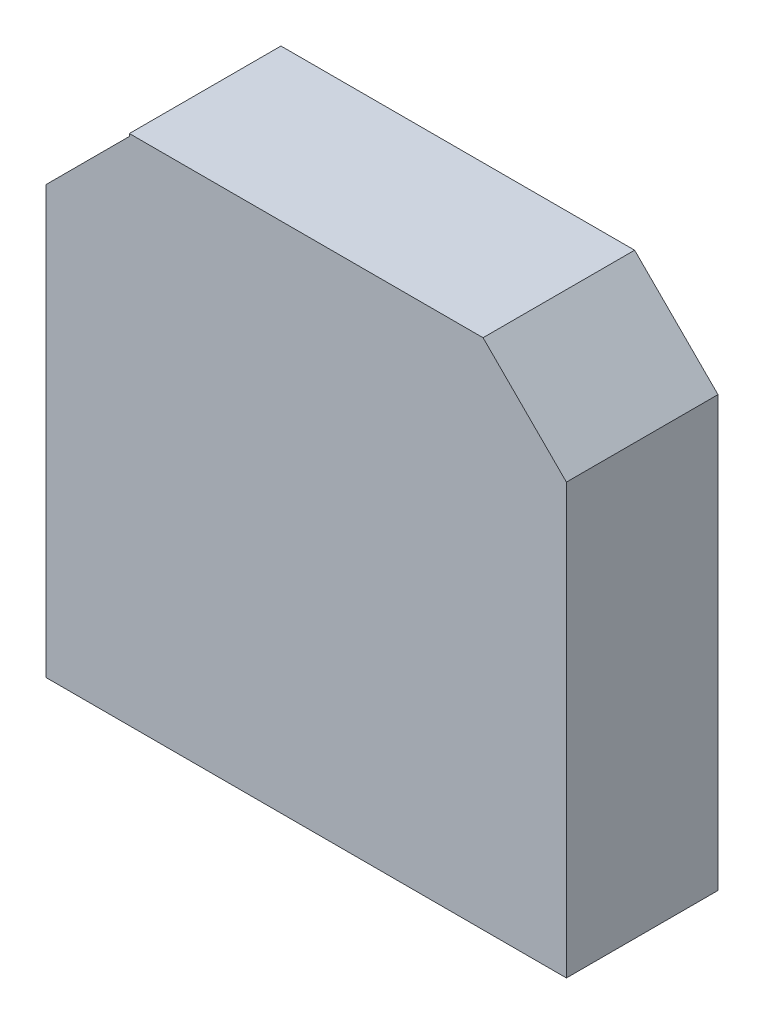
ISO-10303-21;
HEADER;
FILE_DESCRIPTION(('STEP AP214'),'2;1');
FILE_NAME('part.step','',(''),(''),'','','');
FILE_SCHEMA(('AUTOMOTIVE_DESIGN { 1 0 10303 214 1 1 1 1 }'));
ENDSEC;
DATA;
#1=APPLICATION_CONTEXT('core data for automotive mechanical design processes');
#2=APPLICATION_PROTOCOL_DEFINITION('international standard','automotive_design',2000,#1);
#3=PRODUCT_CONTEXT('',#1,'mechanical');
#4=PRODUCT('Part','Part','',(#3));
#5=PRODUCT_RELATED_PRODUCT_CATEGORY('part','',(#4));
#6=PRODUCT_DEFINITION_FORMATION('','',#4);
#7=PRODUCT_DEFINITION_CONTEXT('part definition',#1,'design');
#8=PRODUCT_DEFINITION('design','',#6,#7);
#9=PRODUCT_DEFINITION_SHAPE('','',#8);
#10=(LENGTH_UNIT() NAMED_UNIT(*) SI_UNIT(.MILLI.,.METRE.));
#11=(NAMED_UNIT(*) PLANE_ANGLE_UNIT() SI_UNIT($,.RADIAN.));
#12=(NAMED_UNIT(*) SI_UNIT($,.STERADIAN.) SOLID_ANGLE_UNIT());
#13=UNCERTAINTY_MEASURE_WITH_UNIT(LENGTH_MEASURE(1.E-05),#10,'distance_accuracy_value','');
#14=(GEOMETRIC_REPRESENTATION_CONTEXT(3) GLOBAL_UNCERTAINTY_ASSIGNED_CONTEXT((#13)) GLOBAL_UNIT_ASSIGNED_CONTEXT((#10,
#11,#12)) REPRESENTATION_CONTEXT('',''));
#15=CARTESIAN_POINT('',(0.,0.,0.));
#16=DIRECTION('',(0.,0.,1.));
#17=DIRECTION('',(1.,0.,0.));
#18=AXIS2_PLACEMENT_3D('',#15,#16,#17);
#19=CARTESIAN_POINT('',(-3.50000062,5.07500128,0.));
#20=DIRECTION('',(1.,0.,0.));
#21=DIRECTION('',(0.,0.,-1.));
#22=AXIS2_PLACEMENT_3D('',#19,#20,#21);
#23=PLANE('',#22);
#24=DIRECTION('',(0.,0.,1.));
#25=VECTOR('',#24,1.);
#26=CARTESIAN_POINT('',(-3.50000062,5.02500138,0.));
#27=LINE('',#26,#25);
#28=CARTESIAN_POINT('',(-3.50000062,5.02500138,0.));
#29=VERTEX_POINT('',#28);
#30=CARTESIAN_POINT('',(-3.50000062,5.02500138,2.99999908));
#31=VERTEX_POINT('',#30);
#32=EDGE_CURVE('E79',#29,#31,#27,.T.);
#33=ORIENTED_EDGE('',*,*,#32,.T.);
#34=DIRECTION('',(0.,1.,0.));
#35=VECTOR('',#34,1.);
#36=CARTESIAN_POINT('',(-3.50000062,-5.07499874,2.99999908));
#37=LINE('',#36,#35);
#38=CARTESIAN_POINT('',(-3.50000062,5.07500128,2.99999908));
#39=VERTEX_POINT('',#38);
#40=EDGE_CURVE('E81',#31,#39,#37,.T.);
#41=ORIENTED_EDGE('',*,*,#40,.T.);
#42=DIRECTION('',(0.,0.,-1.));
#43=VECTOR('',#42,1.);
#44=CARTESIAN_POINT('',(-3.50000062,5.07500128,0.));
#45=LINE('',#44,#43);
#46=CARTESIAN_POINT('',(-3.50000062,5.07500128,0.));
#47=VERTEX_POINT('',#46);
#48=EDGE_CURVE('E123',#39,#47,#45,.T.);
#49=ORIENTED_EDGE('',*,*,#48,.T.);
#50=DIRECTION('',(0.,1.,0.));
#51=VECTOR('',#50,1.);
#52=CARTESIAN_POINT('',(-3.50000062,5.07500128,0.));
#53=LINE('',#52,#51);
#54=EDGE_CURVE('E20',#29,#47,#53,.T.);
#55=ORIENTED_EDGE('',*,*,#54,.F.);
#56=EDGE_LOOP('',(#33,#41,#49,#55));
#57=FACE_BOUND('',#56,.T.);
#58=ADVANCED_FACE('F17',(#57),#23,.F.);
#59=CARTESIAN_POINT('',(-5.14999986,-5.07499874,2.99999908));
#60=DIRECTION('',(0.,0.,-1.));
#61=DIRECTION('',(-1.,0.,0.));
#62=AXIS2_PLACEMENT_3D('',#59,#60,#61);
#63=PLANE('',#62);
#64=DIRECTION('',(0.,1.,0.));
#65=VECTOR('',#64,1.);
#66=CARTESIAN_POINT('',(5.14999986,-5.07499874,2.99999908));
#67=LINE('',#66,#65);
#68=CARTESIAN_POINT('',(5.14999986,-5.07499874,2.99999908));
#69=VERTEX_POINT('',#68);
#70=CARTESIAN_POINT('',(5.14999986,3.42500204,2.99999908));
#71=VERTEX_POINT('',#70);
#72=EDGE_CURVE('E117',#69,#71,#67,.T.);
#73=ORIENTED_EDGE('',*,*,#72,.T.);
#74=DIRECTION('',(0.707106781186548,-0.707106781186548,0.));
#75=VECTOR('',#74,1.);
#76=CARTESIAN_POINT('',(5.14999986,3.42500204,2.99999908));
#77=LINE('',#76,#75);
#78=CARTESIAN_POINT('',(3.50000062,5.07500128,2.99999908));
#79=VERTEX_POINT('',#78);
#80=EDGE_CURVE('E121',#71,#79,#77,.F.);
#81=ORIENTED_EDGE('',*,*,#80,.T.);
#82=DIRECTION('',(1.,0.,0.));
#83=VECTOR('',#82,1.);
#84=CARTESIAN_POINT('',(3.50000062,5.07500128,2.99999908));
#85=LINE('',#84,#83);
#86=EDGE_CURVE('E90',#79,#39,#85,.F.);
#87=ORIENTED_EDGE('',*,*,#86,.T.);
#88=ORIENTED_EDGE('',*,*,#40,.F.);
#89=DIRECTION('',(0.707106781186548,0.707106781186548,0.));
#90=VECTOR('',#89,1.);
#91=CARTESIAN_POINT('',(-3.50000062,5.02500138,2.99999908));
#92=LINE('',#91,#90);
#93=CARTESIAN_POINT('',(-5.14999986,3.37500214,2.99999908));
#94=VERTEX_POINT('',#93);
#95=EDGE_CURVE('E74',#31,#94,#92,.F.);
#96=ORIENTED_EDGE('',*,*,#95,.T.);
#97=DIRECTION('',(0.,1.,0.));
#98=VECTOR('',#97,1.);
#99=CARTESIAN_POINT('',(-5.14999986,3.37500214,2.99999908));
#100=LINE('',#99,#98);
#101=CARTESIAN_POINT('',(-5.14999986,-5.07499874,2.99999908));
#102=VERTEX_POINT('',#101);
#103=EDGE_CURVE('E86',#94,#102,#100,.F.);
#104=ORIENTED_EDGE('',*,*,#103,.T.);
#105=DIRECTION('',(1.,0.,0.));
#106=VECTOR('',#105,1.);
#107=CARTESIAN_POINT('',(-5.14999986,-5.07499874,2.99999908));
#108=LINE('',#107,#106);
#109=EDGE_CURVE('E101',#102,#69,#108,.T.);
#110=ORIENTED_EDGE('',*,*,#109,.T.);
#111=EDGE_LOOP('',(#73,#81,#87,#88,#96,#104,#110));
#112=FACE_BOUND('',#111,.T.);
#113=ADVANCED_FACE('F88',(#112),#63,.F.);
#114=CARTESIAN_POINT('',(-5.14999986,3.37500214,0.));
#115=DIRECTION('',(1.,0.,0.));
#116=DIRECTION('',(0.,0.,-1.));
#117=AXIS2_PLACEMENT_3D('',#114,#115,#116);
#118=PLANE('',#117);
#119=DIRECTION('',(0.,0.,1.));
#120=VECTOR('',#119,1.);
#121=CARTESIAN_POINT('',(-5.14999986,-5.07499874,0.));
#122=LINE('',#121,#120);
#123=CARTESIAN_POINT('',(-5.14999986,-5.07499874,0.));
#124=VERTEX_POINT('',#123);
#125=EDGE_CURVE('E104',#124,#102,#122,.T.);
#126=ORIENTED_EDGE('',*,*,#125,.T.);
#127=ORIENTED_EDGE('',*,*,#103,.F.);
#128=DIRECTION('',(0.,0.,1.));
#129=VECTOR('',#128,1.);
#130=CARTESIAN_POINT('',(-5.14999986,3.37500214,0.));
#131=LINE('',#130,#129);
#132=CARTESIAN_POINT('',(-5.14999986,3.37500214,0.));
#133=VERTEX_POINT('',#132);
#134=EDGE_CURVE('E94',#94,#133,#131,.F.);
#135=ORIENTED_EDGE('',*,*,#134,.T.);
#136=DIRECTION('',(0.,1.,0.));
#137=VECTOR('',#136,1.);
#138=CARTESIAN_POINT('',(-5.14999986,-5.07499874,0.));
#139=LINE('',#138,#137);
#140=EDGE_CURVE('E107',#124,#133,#139,.T.);
#141=ORIENTED_EDGE('',*,*,#140,.F.);
#142=EDGE_LOOP('',(#126,#127,#135,#141));
#143=FACE_BOUND('',#142,.T.);
#144=ADVANCED_FACE('F105',(#143),#118,.F.);
#145=CARTESIAN_POINT('',(-3.50000062,5.02500138,0.));
#146=DIRECTION('',(0.707106781186548,-0.707106781186548,0.));
#147=DIRECTION('',(0.707106781186548,0.707106781186548,0.));
#148=AXIS2_PLACEMENT_3D('',#145,#146,#147);
#149=PLANE('',#148);
#150=ORIENTED_EDGE('',*,*,#134,.F.);
#151=ORIENTED_EDGE('',*,*,#95,.F.);
#152=ORIENTED_EDGE('',*,*,#32,.F.);
#153=DIRECTION('',(0.707106781186548,0.707106781186547,0.));
#154=VECTOR('',#153,1.);
#155=CARTESIAN_POINT('',(-5.14999986,3.37500214,0.));
#156=LINE('',#155,#154);
#157=EDGE_CURVE('E134',#133,#29,#156,.T.);
#158=ORIENTED_EDGE('',*,*,#157,.F.);
#159=EDGE_LOOP('',(#150,#151,#152,#158));
#160=FACE_BOUND('',#159,.T.);
#161=ADVANCED_FACE('F93',(#160),#149,.F.);
#162=CARTESIAN_POINT('',(3.50000062,5.07500128,0.));
#163=DIRECTION('',(0.,-1.,0.));
#164=DIRECTION('',(0.,0.,-1.));
#165=AXIS2_PLACEMENT_3D('',#162,#163,#164);
#166=PLANE('',#165);
#167=ORIENTED_EDGE('',*,*,#48,.F.);
#168=ORIENTED_EDGE('',*,*,#86,.F.);
#169=DIRECTION('',(0.,0.,1.));
#170=VECTOR('',#169,1.);
#171=CARTESIAN_POINT('',(3.50000062,5.07500128,0.));
#172=LINE('',#171,#170);
#173=CARTESIAN_POINT('',(3.50000062,5.07500128,0.));
#174=VERTEX_POINT('',#173);
#175=EDGE_CURVE('E119',#79,#174,#172,.F.);
#176=ORIENTED_EDGE('',*,*,#175,.T.);
#177=DIRECTION('',(-1.,0.,0.));
#178=VECTOR('',#177,1.);
#179=CARTESIAN_POINT('',(-5.14999986,5.07500128,0.));
#180=LINE('',#179,#178);
#181=EDGE_CURVE('E127',#47,#174,#180,.F.);
#182=ORIENTED_EDGE('',*,*,#181,.F.);
#183=EDGE_LOOP('',(#167,#168,#176,#182));
#184=FACE_BOUND('',#183,.T.);
#185=ADVANCED_FACE('F128',(#184),#166,.F.);
#186=CARTESIAN_POINT('',(5.14999986,3.42500204,0.));
#187=DIRECTION('',(-0.707106781186548,-0.707106781186548,0.));
#188=DIRECTION('',(0.707106781186548,-0.707106781186548,0.));
#189=AXIS2_PLACEMENT_3D('',#186,#187,#188);
#190=PLANE('',#189);
#191=ORIENTED_EDGE('',*,*,#175,.F.);
#192=ORIENTED_EDGE('',*,*,#80,.F.);
#193=DIRECTION('',(0.,0.,1.));
#194=VECTOR('',#193,1.);
#195=CARTESIAN_POINT('',(5.14999986,3.42500204,0.));
#196=LINE('',#195,#194);
#197=CARTESIAN_POINT('',(5.14999986,3.42500204,0.));
#198=VERTEX_POINT('',#197);
#199=EDGE_CURVE('E109',#71,#198,#196,.F.);
#200=ORIENTED_EDGE('',*,*,#199,.T.);
#201=DIRECTION('',(0.707106781186548,-0.707106781186548,0.));
#202=VECTOR('',#201,1.);
#203=CARTESIAN_POINT('',(3.50000062,5.07500128,0.));
#204=LINE('',#203,#202);
#205=EDGE_CURVE('E133',#174,#198,#204,.T.);
#206=ORIENTED_EDGE('',*,*,#205,.F.);
#207=EDGE_LOOP('',(#191,#192,#200,#206));
#208=FACE_BOUND('',#207,.T.);
#209=ADVANCED_FACE('F145',(#208),#190,.F.);
#210=CARTESIAN_POINT('',(5.14999986,-5.07499874,0.));
#211=DIRECTION('',(-1.,0.,0.));
#212=DIRECTION('',(0.,0.,1.));
#213=AXIS2_PLACEMENT_3D('',#210,#211,#212);
#214=PLANE('',#213);
#215=ORIENTED_EDGE('',*,*,#199,.F.);
#216=ORIENTED_EDGE('',*,*,#72,.F.);
#217=DIRECTION('',(0.,0.,1.));
#218=VECTOR('',#217,1.);
#219=CARTESIAN_POINT('',(5.14999986,-5.07499874,0.));
#220=LINE('',#219,#218);
#221=CARTESIAN_POINT('',(5.14999986,-5.07499874,0.));
#222=VERTEX_POINT('',#221);
#223=EDGE_CURVE('E35',#69,#222,#220,.F.);
#224=ORIENTED_EDGE('',*,*,#223,.T.);
#225=DIRECTION('',(0.,1.,0.));
#226=VECTOR('',#225,1.);
#227=CARTESIAN_POINT('',(5.14999986,-5.07499874,0.));
#228=LINE('',#227,#226);
#229=EDGE_CURVE('E26',#198,#222,#228,.F.);
#230=ORIENTED_EDGE('',*,*,#229,.F.);
#231=EDGE_LOOP('',(#215,#216,#224,#230));
#232=FACE_BOUND('',#231,.T.);
#233=ADVANCED_FACE('F142',(#232),#214,.F.);
#234=CARTESIAN_POINT('',(-5.14999986,-5.07499874,0.));
#235=DIRECTION('',(0.,1.,0.));
#236=DIRECTION('',(0.,0.,1.));
#237=AXIS2_PLACEMENT_3D('',#234,#235,#236);
#238=PLANE('',#237);
#239=ORIENTED_EDGE('',*,*,#223,.F.);
#240=ORIENTED_EDGE('',*,*,#109,.F.);
#241=ORIENTED_EDGE('',*,*,#125,.F.);
#242=DIRECTION('',(-1.,0.,0.));
#243=VECTOR('',#242,1.);
#244=CARTESIAN_POINT('',(-5.14999986,-5.07499874,0.));
#245=LINE('',#244,#243);
#246=EDGE_CURVE('E11',#222,#124,#245,.T.);
#247=ORIENTED_EDGE('',*,*,#246,.F.);
#248=EDGE_LOOP('',(#239,#240,#241,#247));
#249=FACE_BOUND('',#248,.T.);
#250=ADVANCED_FACE('F111',(#249),#238,.F.);
#251=CARTESIAN_POINT('',(-5.14999986,-5.07499874,0.));
#252=DIRECTION('',(0.,0.,-1.));
#253=DIRECTION('',(-1.,0.,0.));
#254=AXIS2_PLACEMENT_3D('',#251,#252,#253);
#255=PLANE('',#254);
#256=ORIENTED_EDGE('',*,*,#229,.T.);
#257=ORIENTED_EDGE('',*,*,#246,.T.);
#258=ORIENTED_EDGE('',*,*,#140,.T.);
#259=ORIENTED_EDGE('',*,*,#157,.T.);
#260=ORIENTED_EDGE('',*,*,#54,.T.);
#261=ORIENTED_EDGE('',*,*,#181,.T.);
#262=ORIENTED_EDGE('',*,*,#205,.T.);
#263=EDGE_LOOP('',(#256,#257,#258,#259,#260,#261,#262));
#264=FACE_BOUND('',#263,.T.);
#265=ADVANCED_FACE('F140',(#264),#255,.T.);
#266=CLOSED_SHELL('',(#58,#113,#144,#161,#185,#209,#233,#250,#265));
#267=MANIFOLD_SOLID_BREP('B1',#266);
#268=ADVANCED_BREP_SHAPE_REPRESENTATION('',(#18,#267),#14);
#269=SHAPE_DEFINITION_REPRESENTATION(#9,#268);
ENDSEC;
END-ISO-10303-21;
